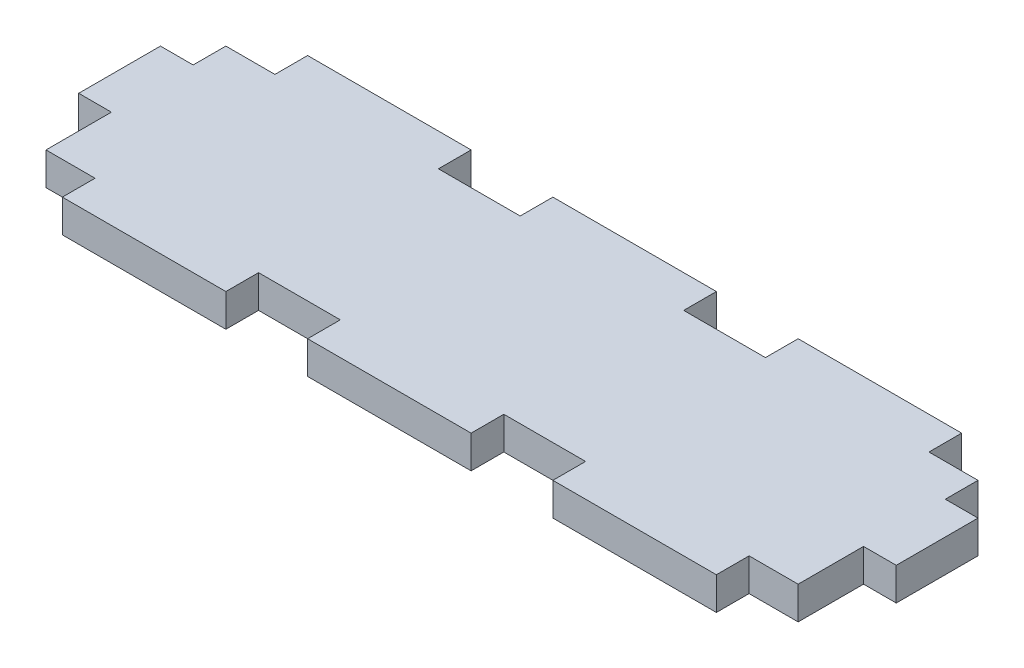
ISO-10303-21;
HEADER;
FILE_DESCRIPTION(('STEP AP214'),'2;1');
FILE_NAME('part.step','',(''),(''),'','','');
FILE_SCHEMA(('AUTOMOTIVE_DESIGN { 1 0 10303 214 1 1 1 1 }'));
ENDSEC;
DATA;
#1=APPLICATION_CONTEXT('core data for automotive mechanical design processes');
#2=APPLICATION_PROTOCOL_DEFINITION('international standard','automotive_design',2000,#1);
#3=PRODUCT_CONTEXT('',#1,'mechanical');
#4=PRODUCT('Part','Part','',(#3));
#5=PRODUCT_RELATED_PRODUCT_CATEGORY('part','',(#4));
#6=PRODUCT_DEFINITION_FORMATION('','',#4);
#7=PRODUCT_DEFINITION_CONTEXT('part definition',#1,'design');
#8=PRODUCT_DEFINITION('design','',#6,#7);
#9=PRODUCT_DEFINITION_SHAPE('','',#8);
#10=(LENGTH_UNIT() NAMED_UNIT(*) SI_UNIT(.MILLI.,.METRE.));
#11=(NAMED_UNIT(*) PLANE_ANGLE_UNIT() SI_UNIT($,.RADIAN.));
#12=(NAMED_UNIT(*) SI_UNIT($,.STERADIAN.) SOLID_ANGLE_UNIT());
#13=UNCERTAINTY_MEASURE_WITH_UNIT(LENGTH_MEASURE(1.E-05),#10,'distance_accuracy_value','');
#14=(GEOMETRIC_REPRESENTATION_CONTEXT(3) GLOBAL_UNCERTAINTY_ASSIGNED_CONTEXT((#13)) GLOBAL_UNIT_ASSIGNED_CONTEXT((#10,
#11,#12)) REPRESENTATION_CONTEXT('',''));
#15=CARTESIAN_POINT('',(0.,0.,0.));
#16=DIRECTION('',(0.,0.,1.));
#17=DIRECTION('',(1.,0.,0.));
#18=AXIS2_PLACEMENT_3D('',#15,#16,#17);
#19=CARTESIAN_POINT('',(-58.42,-119.490382641529,-13.97));
#20=DIRECTION('',(0.,0.,1.));
#21=DIRECTION('',(1.,0.,0.));
#22=AXIS2_PLACEMENT_3D('',#19,#20,#21);
#23=PLANE('',#22);
#24=DIRECTION('',(1.,0.,0.));
#25=VECTOR('',#24,1.);
#26=CARTESIAN_POINT('',(-58.42,2.54,-13.97));
#27=LINE('',#26,#25);
#28=CARTESIAN_POINT('',(12.7,2.54,-13.97));
#29=VERTEX_POINT('',#28);
#30=CARTESIAN_POINT('',(25.4,2.54,-13.97));
#31=VERTEX_POINT('',#30);
#32=EDGE_CURVE('E61',#29,#31,#27,.T.);
#33=ORIENTED_EDGE('',*,*,#32,.T.);
#34=DIRECTION('',(0.,1.,0.));
#35=VECTOR('',#34,1.);
#36=CARTESIAN_POINT('',(25.4,-28.4430191290514,-13.97));
#37=LINE('',#36,#35);
#38=CARTESIAN_POINT('',(25.4,-2.54,-13.97));
#39=VERTEX_POINT('',#38);
#40=EDGE_CURVE('E296',#39,#31,#37,.T.);
#41=ORIENTED_EDGE('',*,*,#40,.F.);
#42=DIRECTION('',(-1.,0.,0.));
#43=VECTOR('',#42,1.);
#44=CARTESIAN_POINT('',(-58.42,-2.54,-13.97));
#45=LINE('',#44,#43);
#46=CARTESIAN_POINT('',(12.7,-2.54,-13.97));
#47=VERTEX_POINT('',#46);
#48=EDGE_CURVE('E359',#39,#47,#45,.T.);
#49=ORIENTED_EDGE('',*,*,#48,.T.);
#50=DIRECTION('',(0.,1.,0.));
#51=VECTOR('',#50,1.);
#52=CARTESIAN_POINT('',(12.7,-28.4430191290514,-13.97));
#53=LINE('',#52,#51);
#54=EDGE_CURVE('E326',#47,#29,#53,.T.);
#55=ORIENTED_EDGE('',*,*,#54,.T.);
#56=EDGE_LOOP('',(#33,#41,#49,#55));
#57=FACE_BOUND('',#56,.T.);
#58=ADVANCED_FACE('F35',(#57),#23,.F.);
#59=CARTESIAN_POINT('',(-25.4,2.54,-13.97));
#60=VERTEX_POINT('',#59);
#61=CARTESIAN_POINT('',(-12.7,2.54,-13.97));
#62=VERTEX_POINT('',#61);
#63=EDGE_CURVE('E600',#60,#62,#27,.T.);
#64=ORIENTED_EDGE('',*,*,#63,.T.);
#65=DIRECTION('',(0.,1.,0.));
#66=VECTOR('',#65,1.);
#67=CARTESIAN_POINT('',(-12.7,-28.4430191290514,-13.97));
#68=LINE('',#67,#66);
#69=CARTESIAN_POINT('',(-12.7,-2.54,-13.97));
#70=VERTEX_POINT('',#69);
#71=EDGE_CURVE('E322',#70,#62,#68,.T.);
#72=ORIENTED_EDGE('',*,*,#71,.F.);
#73=CARTESIAN_POINT('',(-25.4,-2.54,-13.97));
#74=VERTEX_POINT('',#73);
#75=EDGE_CURVE('E356',#70,#74,#45,.T.);
#76=ORIENTED_EDGE('',*,*,#75,.T.);
#77=DIRECTION('',(0.,1.,0.));
#78=VECTOR('',#77,1.);
#79=CARTESIAN_POINT('',(-25.4,-28.4430191290514,-13.97));
#80=LINE('',#79,#78);
#81=EDGE_CURVE('E343',#74,#60,#80,.T.);
#82=ORIENTED_EDGE('',*,*,#81,.T.);
#83=EDGE_LOOP('',(#64,#72,#76,#82));
#84=FACE_BOUND('',#83,.T.);
#85=ADVANCED_FACE('F624',(#84),#23,.F.);
#86=DIRECTION('',(0.,1.,0.));
#87=VECTOR('',#86,1.);
#88=CARTESIAN_POINT('',(-50.8,-28.4430191290514,-13.97));
#89=LINE('',#88,#87);
#90=CARTESIAN_POINT('',(-50.8,-2.54,-13.97));
#91=VERTEX_POINT('',#90);
#92=CARTESIAN_POINT('',(-50.8,2.54,-13.97));
#93=VERTEX_POINT('',#92);
#94=EDGE_CURVE('E337',#91,#93,#89,.T.);
#95=ORIENTED_EDGE('',*,*,#94,.F.);
#96=CARTESIAN_POINT('',(-58.42,-2.54,-13.97));
#97=VERTEX_POINT('',#96);
#98=EDGE_CURVE('E360',#91,#97,#45,.T.);
#99=ORIENTED_EDGE('',*,*,#98,.T.);
#100=DIRECTION('',(0.,1.,0.));
#101=VECTOR('',#100,1.);
#102=CARTESIAN_POINT('',(-58.42,-119.490382641529,-13.97));
#103=LINE('',#102,#101);
#104=CARTESIAN_POINT('',(-58.42,2.54,-13.97));
#105=VERTEX_POINT('',#104);
#106=EDGE_CURVE('E364',#97,#105,#103,.T.);
#107=ORIENTED_EDGE('',*,*,#106,.T.);
#108=EDGE_CURVE('E595',#105,#93,#27,.T.);
#109=ORIENTED_EDGE('',*,*,#108,.T.);
#110=EDGE_LOOP('',(#95,#99,#107,#109));
#111=FACE_BOUND('',#110,.T.);
#112=ADVANCED_FACE('F654',(#111),#23,.F.);
#113=CARTESIAN_POINT('',(63.5,2.54,19.05));
#114=DIRECTION('',(0.,0.,-1.));
#115=DIRECTION('',(-1.,0.,0.));
#116=AXIS2_PLACEMENT_3D('',#113,#114,#115);
#117=PLANE('',#116);
#118=DIRECTION('',(1.,0.,0.));
#119=VECTOR('',#118,1.);
#120=CARTESIAN_POINT('',(63.5,2.54,19.05));
#121=LINE('',#120,#119);
#122=CARTESIAN_POINT('',(25.4,2.54,19.05));
#123=VERTEX_POINT('',#122);
#124=CARTESIAN_POINT('',(50.8,2.54,19.05));
#125=VERTEX_POINT('',#124);
#126=EDGE_CURVE('E397',#123,#125,#121,.T.);
#127=ORIENTED_EDGE('',*,*,#126,.F.);
#128=DIRECTION('',(0.,1.,0.));
#129=VECTOR('',#128,1.);
#130=CARTESIAN_POINT('',(25.4,-16.2183186101216,19.05));
#131=LINE('',#130,#129);
#132=CARTESIAN_POINT('',(25.4,-2.54,19.05));
#133=VERTEX_POINT('',#132);
#134=EDGE_CURVE('E523',#133,#123,#131,.T.);
#135=ORIENTED_EDGE('',*,*,#134,.F.);
#136=DIRECTION('',(1.,0.,0.));
#137=VECTOR('',#136,1.);
#138=CARTESIAN_POINT('',(63.5,-2.54,19.05));
#139=LINE('',#138,#137);
#140=CARTESIAN_POINT('',(50.8,-2.54,19.05));
#141=VERTEX_POINT('',#140);
#142=EDGE_CURVE('E387',#133,#141,#139,.T.);
#143=ORIENTED_EDGE('',*,*,#142,.T.);
#144=DIRECTION('',(0.,1.,0.));
#145=VECTOR('',#144,1.);
#146=CARTESIAN_POINT('',(50.8,-16.2183186101216,19.05));
#147=LINE('',#146,#145);
#148=EDGE_CURVE('E473',#141,#125,#147,.T.);
#149=ORIENTED_EDGE('',*,*,#148,.T.);
#150=EDGE_LOOP('',(#127,#135,#143,#149));
#151=FACE_BOUND('',#150,.T.);
#152=ADVANCED_FACE('F560',(#151),#117,.F.);
#153=CARTESIAN_POINT('',(-12.7,-2.54,19.05));
#154=VERTEX_POINT('',#153);
#155=CARTESIAN_POINT('',(12.7,-2.54,19.05));
#156=VERTEX_POINT('',#155);
#157=EDGE_CURVE('E386',#154,#156,#139,.T.);
#158=ORIENTED_EDGE('',*,*,#157,.T.);
#159=DIRECTION('',(0.,1.,0.));
#160=VECTOR('',#159,1.);
#161=CARTESIAN_POINT('',(12.7,-16.2183186101216,19.05));
#162=LINE('',#161,#160);
#163=CARTESIAN_POINT('',(12.7,2.54,19.05));
#164=VERTEX_POINT('',#163);
#165=EDGE_CURVE('E520',#156,#164,#162,.T.);
#166=ORIENTED_EDGE('',*,*,#165,.T.);
#167=CARTESIAN_POINT('',(-12.7,2.54,19.05));
#168=VERTEX_POINT('',#167);
#169=EDGE_CURVE('E396',#168,#164,#121,.T.);
#170=ORIENTED_EDGE('',*,*,#169,.F.);
#171=DIRECTION('',(0.,1.,0.));
#172=VECTOR('',#171,1.);
#173=CARTESIAN_POINT('',(-12.7,-16.2183186101216,19.05));
#174=LINE('',#173,#172);
#175=EDGE_CURVE('E500',#154,#168,#174,.T.);
#176=ORIENTED_EDGE('',*,*,#175,.F.);
#177=EDGE_LOOP('',(#158,#166,#170,#176));
#178=FACE_BOUND('',#177,.T.);
#179=ADVANCED_FACE('F555',(#178),#117,.F.);
#180=CARTESIAN_POINT('',(0.,2.54,0.));
#181=DIRECTION('',(0.,1.,0.));
#182=DIRECTION('',(0.,0.,1.));
#183=AXIS2_PLACEMENT_3D('',#180,#181,#182);
#184=PLANE('',#183);
#185=ORIENTED_EDGE('',*,*,#108,.F.);
#186=DIRECTION('',(0.,0.,-1.));
#187=VECTOR('',#186,1.);
#188=CARTESIAN_POINT('',(-58.42,2.54,-19.05));
#189=LINE('',#188,#187);
#190=CARTESIAN_POINT('',(-58.42,2.54,-8.89));
#191=VERTEX_POINT('',#190);
#192=EDGE_CURVE('E408',#191,#105,#189,.T.);
#193=ORIENTED_EDGE('',*,*,#192,.F.);
#194=DIRECTION('',(1.,0.,0.));
#195=VECTOR('',#194,1.);
#196=CARTESIAN_POINT('',(-63.5,2.54,-8.89));
#197=LINE('',#196,#195);
#198=CARTESIAN_POINT('',(-63.5,2.54,-8.89));
#199=VERTEX_POINT('',#198);
#200=EDGE_CURVE('E404',#199,#191,#197,.T.);
#201=ORIENTED_EDGE('',*,*,#200,.F.);
#202=DIRECTION('',(0.,0.,1.));
#203=VECTOR('',#202,1.);
#204=CARTESIAN_POINT('',(-63.5,2.54,19.05));
#205=LINE('',#204,#203);
#206=CARTESIAN_POINT('',(-63.5,2.54,3.80999999999999));
#207=VERTEX_POINT('',#206);
#208=EDGE_CURVE('E382',#199,#207,#205,.T.);
#209=ORIENTED_EDGE('',*,*,#208,.T.);
#210=DIRECTION('',(-1.,0.,0.));
#211=VECTOR('',#210,1.);
#212=CARTESIAN_POINT('',(-63.5,2.54,3.80999999999999));
#213=LINE('',#212,#211);
#214=CARTESIAN_POINT('',(-58.42,2.54,3.80999999999999));
#215=VERTEX_POINT('',#214);
#216=EDGE_CURVE('E422',#215,#207,#213,.T.);
#217=ORIENTED_EDGE('',*,*,#216,.F.);
#218=DIRECTION('',(0.,0.,-1.));
#219=VECTOR('',#218,1.);
#220=CARTESIAN_POINT('',(-58.42,2.54,3.80999999999999));
#221=LINE('',#220,#219);
#222=CARTESIAN_POINT('',(-58.42,2.54,13.97));
#223=VERTEX_POINT('',#222);
#224=EDGE_CURVE('E425',#223,#215,#221,.T.);
#225=ORIENTED_EDGE('',*,*,#224,.F.);
#226=DIRECTION('',(-1.,0.,0.));
#227=VECTOR('',#226,1.);
#228=CARTESIAN_POINT('',(-63.5,2.54,13.97));
#229=LINE('',#228,#227);
#230=CARTESIAN_POINT('',(-50.8,2.54,13.97));
#231=VERTEX_POINT('',#230);
#232=EDGE_CURVE('E465',#231,#223,#229,.T.);
#233=ORIENTED_EDGE('',*,*,#232,.F.);
#234=DIRECTION('',(0.,0.,-1.));
#235=VECTOR('',#234,1.);
#236=CARTESIAN_POINT('',(-50.8,2.54,13.97));
#237=LINE('',#236,#235);
#238=CARTESIAN_POINT('',(-50.8,2.54,19.05));
#239=VERTEX_POINT('',#238);
#240=EDGE_CURVE('E468',#239,#231,#237,.T.);
#241=ORIENTED_EDGE('',*,*,#240,.F.);
#242=CARTESIAN_POINT('',(-25.4,2.54,19.05));
#243=VERTEX_POINT('',#242);
#244=EDGE_CURVE('E393',#239,#243,#121,.T.);
#245=ORIENTED_EDGE('',*,*,#244,.T.);
#246=DIRECTION('',(0.,0.,1.));
#247=VECTOR('',#246,1.);
#248=CARTESIAN_POINT('',(-25.4,2.54,13.97));
#249=LINE('',#248,#247);
#250=CARTESIAN_POINT('',(-25.4,2.54,13.97));
#251=VERTEX_POINT('',#250);
#252=EDGE_CURVE('E495',#251,#243,#249,.T.);
#253=ORIENTED_EDGE('',*,*,#252,.F.);
#254=DIRECTION('',(-1.,0.,0.));
#255=VECTOR('',#254,1.);
#256=CARTESIAN_POINT('',(-25.4,2.54,13.97));
#257=LINE('',#256,#255);
#258=CARTESIAN_POINT('',(-12.7,2.54,13.97));
#259=VERTEX_POINT('',#258);
#260=EDGE_CURVE('E504',#259,#251,#257,.T.);
#261=ORIENTED_EDGE('',*,*,#260,.F.);
#262=DIRECTION('',(0.,0.,-1.));
#263=VECTOR('',#262,1.);
#264=CARTESIAN_POINT('',(-12.7,2.54,13.97));
#265=LINE('',#264,#263);
#266=EDGE_CURVE('E507',#168,#259,#265,.T.);
#267=ORIENTED_EDGE('',*,*,#266,.F.);
#268=ORIENTED_EDGE('',*,*,#169,.T.);
#269=DIRECTION('',(0.,0.,1.));
#270=VECTOR('',#269,1.);
#271=CARTESIAN_POINT('',(12.7,2.54,13.97));
#272=LINE('',#271,#270);
#273=CARTESIAN_POINT('',(12.7,2.54,13.97));
#274=VERTEX_POINT('',#273);
#275=EDGE_CURVE('E518',#274,#164,#272,.T.);
#276=ORIENTED_EDGE('',*,*,#275,.F.);
#277=DIRECTION('',(-1.,0.,0.));
#278=VECTOR('',#277,1.);
#279=CARTESIAN_POINT('',(12.7,2.54,13.97));
#280=LINE('',#279,#278);
#281=CARTESIAN_POINT('',(25.4,2.54,13.97));
#282=VERTEX_POINT('',#281);
#283=EDGE_CURVE('E526',#282,#274,#280,.T.);
#284=ORIENTED_EDGE('',*,*,#283,.F.);
#285=DIRECTION('',(0.,0.,-1.));
#286=VECTOR('',#285,1.);
#287=CARTESIAN_POINT('',(25.4,2.54,13.97));
#288=LINE('',#287,#286);
#289=EDGE_CURVE('E375',#123,#282,#288,.T.);
#290=ORIENTED_EDGE('',*,*,#289,.F.);
#291=ORIENTED_EDGE('',*,*,#126,.T.);
#292=DIRECTION('',(0.,0.,-1.));
#293=VECTOR('',#292,1.);
#294=CARTESIAN_POINT('',(50.8,2.54,13.97));
#295=LINE('',#294,#293);
#296=CARTESIAN_POINT('',(50.8,2.54,13.97));
#297=VERTEX_POINT('',#296);
#298=EDGE_CURVE('E482',#125,#297,#295,.T.);
#299=ORIENTED_EDGE('',*,*,#298,.T.);
#300=DIRECTION('',(1.,0.,0.));
#301=VECTOR('',#300,1.);
#302=CARTESIAN_POINT('',(63.5,2.54,13.97));
#303=LINE('',#302,#301);
#304=CARTESIAN_POINT('',(58.42,2.54,13.97));
#305=VERTEX_POINT('',#304);
#306=EDGE_CURVE('E477',#297,#305,#303,.T.);
#307=ORIENTED_EDGE('',*,*,#306,.T.);
#308=DIRECTION('',(0.,0.,-1.));
#309=VECTOR('',#308,1.);
#310=CARTESIAN_POINT('',(58.42,2.54,3.80999999999999));
#311=LINE('',#310,#309);
#312=CARTESIAN_POINT('',(58.42,2.54,3.80999999999999));
#313=VERTEX_POINT('',#312);
#314=EDGE_CURVE('E455',#305,#313,#311,.T.);
#315=ORIENTED_EDGE('',*,*,#314,.T.);
#316=DIRECTION('',(1.,0.,0.));
#317=VECTOR('',#316,1.);
#318=CARTESIAN_POINT('',(63.5,2.54,3.80999999999999));
#319=LINE('',#318,#317);
#320=CARTESIAN_POINT('',(63.5,2.54,3.80999999999999));
#321=VERTEX_POINT('',#320);
#322=EDGE_CURVE('E451',#313,#321,#319,.T.);
#323=ORIENTED_EDGE('',*,*,#322,.T.);
#324=DIRECTION('',(0.,0.,-1.));
#325=VECTOR('',#324,1.);
#326=CARTESIAN_POINT('',(63.5,2.54,19.05));
#327=LINE('',#326,#325);
#328=CARTESIAN_POINT('',(63.5,2.54,-8.89));
#329=VERTEX_POINT('',#328);
#330=EDGE_CURVE('E379',#321,#329,#327,.T.);
#331=ORIENTED_EDGE('',*,*,#330,.T.);
#332=DIRECTION('',(-1.,0.,0.));
#333=VECTOR('',#332,1.);
#334=CARTESIAN_POINT('',(63.5,2.54,-8.89));
#335=LINE('',#334,#333);
#336=CARTESIAN_POINT('',(58.42,2.54,-8.89));
#337=VERTEX_POINT('',#336);
#338=EDGE_CURVE('E436',#329,#337,#335,.T.);
#339=ORIENTED_EDGE('',*,*,#338,.T.);
#340=DIRECTION('',(0.,0.,-1.));
#341=VECTOR('',#340,1.);
#342=CARTESIAN_POINT('',(58.42,2.54,-19.05));
#343=LINE('',#342,#341);
#344=CARTESIAN_POINT('',(58.42,2.54,-13.97));
#345=VERTEX_POINT('',#344);
#346=EDGE_CURVE('E440',#337,#345,#343,.T.);
#347=ORIENTED_EDGE('',*,*,#346,.T.);
#348=CARTESIAN_POINT('',(50.8,2.54,-13.97));
#349=VERTEX_POINT('',#348);
#350=EDGE_CURVE('E39',#349,#345,#27,.T.);
#351=ORIENTED_EDGE('',*,*,#350,.F.);
#352=DIRECTION('',(0.,0.,-1.));
#353=VECTOR('',#352,1.);
#354=CARTESIAN_POINT('',(50.8,2.54,-13.97));
#355=LINE('',#354,#353);
#356=CARTESIAN_POINT('',(50.8,2.54,-19.05));
#357=VERTEX_POINT('',#356);
#358=EDGE_CURVE('E276',#349,#357,#355,.T.);
#359=ORIENTED_EDGE('',*,*,#358,.T.);
#360=DIRECTION('',(-1.,0.,0.));
#361=VECTOR('',#360,1.);
#362=CARTESIAN_POINT('',(25.4,2.54,-19.05));
#363=LINE('',#362,#361);
#364=CARTESIAN_POINT('',(25.4,2.54,-19.05));
#365=VERTEX_POINT('',#364);
#366=EDGE_CURVE('E289',#357,#365,#363,.T.);
#367=ORIENTED_EDGE('',*,*,#366,.T.);
#368=DIRECTION('',(0.,0.,1.));
#369=VECTOR('',#368,1.);
#370=CARTESIAN_POINT('',(25.4,2.54,-13.97));
#371=LINE('',#370,#369);
#372=EDGE_CURVE('E291',#365,#31,#371,.T.);
#373=ORIENTED_EDGE('',*,*,#372,.T.);
#374=ORIENTED_EDGE('',*,*,#32,.F.);
#375=DIRECTION('',(0.,0.,-1.));
#376=VECTOR('',#375,1.);
#377=CARTESIAN_POINT('',(12.7,2.54,-13.97));
#378=LINE('',#377,#376);
#379=CARTESIAN_POINT('',(12.7,2.54,-19.05));
#380=VERTEX_POINT('',#379);
#381=EDGE_CURVE('E315',#29,#380,#378,.T.);
#382=ORIENTED_EDGE('',*,*,#381,.T.);
#383=DIRECTION('',(-1.,0.,0.));
#384=VECTOR('',#383,1.);
#385=CARTESIAN_POINT('',(-12.7,2.54,-19.05));
#386=LINE('',#385,#384);
#387=CARTESIAN_POINT('',(-12.7,2.54,-19.05));
#388=VERTEX_POINT('',#387);
#389=EDGE_CURVE('E319',#380,#388,#386,.T.);
#390=ORIENTED_EDGE('',*,*,#389,.T.);
#391=DIRECTION('',(0.,0.,1.));
#392=VECTOR('',#391,1.);
#393=CARTESIAN_POINT('',(-12.7,2.54,-13.97));
#394=LINE('',#393,#392);
#395=EDGE_CURVE('E312',#388,#62,#394,.T.);
#396=ORIENTED_EDGE('',*,*,#395,.T.);
#397=ORIENTED_EDGE('',*,*,#63,.F.);
#398=DIRECTION('',(0.,0.,-1.));
#399=VECTOR('',#398,1.);
#400=CARTESIAN_POINT('',(-25.4,2.54,-19.05));
#401=LINE('',#400,#399);
#402=CARTESIAN_POINT('',(-25.4,2.54,-19.05));
#403=VERTEX_POINT('',#402);
#404=EDGE_CURVE('E338',#60,#403,#401,.T.);
#405=ORIENTED_EDGE('',*,*,#404,.T.);
#406=DIRECTION('',(-1.,0.,0.));
#407=VECTOR('',#406,1.);
#408=CARTESIAN_POINT('',(-50.8,2.54,-19.05));
#409=LINE('',#408,#407);
#410=CARTESIAN_POINT('',(-50.8,2.54,-19.05));
#411=VERTEX_POINT('',#410);
#412=EDGE_CURVE('E334',#403,#411,#409,.T.);
#413=ORIENTED_EDGE('',*,*,#412,.T.);
#414=DIRECTION('',(0.,0.,1.));
#415=VECTOR('',#414,1.);
#416=CARTESIAN_POINT('',(-50.8,2.54,-19.05));
#417=LINE('',#416,#415);
#418=EDGE_CURVE('E311',#411,#93,#417,.T.);
#419=ORIENTED_EDGE('',*,*,#418,.T.);
#420=EDGE_LOOP('',(#185,#193,#201,#209,#217,#225,#233,#241,#245,#253,#261,#267,#268,#276,#284,
#290,#291,#299,#307,#315,#323,#331,#339,#347,#351,#359,#367,#373,#374,#382,#390,#396,#397,#405,
#413,#419));
#421=FACE_BOUND('',#420,.T.);
#422=ADVANCED_FACE('F287',(#421),#184,.T.);
#423=CARTESIAN_POINT('',(0.,-2.54,0.));
#424=DIRECTION('',(0.,1.,0.));
#425=DIRECTION('',(0.,0.,1.));
#426=AXIS2_PLACEMENT_3D('',#423,#424,#425);
#427=PLANE('',#426);
#428=DIRECTION('',(0.,0.,-1.));
#429=VECTOR('',#428,1.);
#430=CARTESIAN_POINT('',(-58.42,-2.54,-19.05));
#431=LINE('',#430,#429);
#432=CARTESIAN_POINT('',(-58.42,-2.54,-8.89));
#433=VERTEX_POINT('',#432);
#434=EDGE_CURVE('E407',#433,#97,#431,.T.);
#435=ORIENTED_EDGE('',*,*,#434,.T.);
#436=ORIENTED_EDGE('',*,*,#98,.F.);
#437=DIRECTION('',(0.,0.,-1.));
#438=VECTOR('',#437,1.);
#439=CARTESIAN_POINT('',(-50.8,-2.54,-19.05));
#440=LINE('',#439,#438);
#441=CARTESIAN_POINT('',(-50.8,-2.54,-19.05));
#442=VERTEX_POINT('',#441);
#443=EDGE_CURVE('E332',#91,#442,#440,.T.);
#444=ORIENTED_EDGE('',*,*,#443,.T.);
#445=DIRECTION('',(1.,0.,0.));
#446=VECTOR('',#445,1.);
#447=CARTESIAN_POINT('',(-50.8,-2.54,-19.05));
#448=LINE('',#447,#446);
#449=CARTESIAN_POINT('',(-25.4,-2.54,-19.05));
#450=VERTEX_POINT('',#449);
#451=EDGE_CURVE('E330',#442,#450,#448,.T.);
#452=ORIENTED_EDGE('',*,*,#451,.T.);
#453=DIRECTION('',(0.,0.,1.));
#454=VECTOR('',#453,1.);
#455=CARTESIAN_POINT('',(-25.4,-2.54,-19.05));
#456=LINE('',#455,#454);
#457=EDGE_CURVE('E333',#450,#74,#456,.T.);
#458=ORIENTED_EDGE('',*,*,#457,.T.);
#459=ORIENTED_EDGE('',*,*,#75,.F.);
#460=DIRECTION('',(0.,0.,-1.));
#461=VECTOR('',#460,1.);
#462=CARTESIAN_POINT('',(-12.7,-2.54,-13.97));
#463=LINE('',#462,#461);
#464=CARTESIAN_POINT('',(-12.7,-2.54,-19.05));
#465=VERTEX_POINT('',#464);
#466=EDGE_CURVE('E309',#70,#465,#463,.T.);
#467=ORIENTED_EDGE('',*,*,#466,.T.);
#468=DIRECTION('',(1.,0.,0.));
#469=VECTOR('',#468,1.);
#470=CARTESIAN_POINT('',(-12.7,-2.54,-19.05));
#471=LINE('',#470,#469);
#472=CARTESIAN_POINT('',(12.7,-2.54,-19.05));
#473=VERTEX_POINT('',#472);
#474=EDGE_CURVE('E306',#465,#473,#471,.T.);
#475=ORIENTED_EDGE('',*,*,#474,.T.);
#476=DIRECTION('',(0.,0.,1.));
#477=VECTOR('',#476,1.);
#478=CARTESIAN_POINT('',(12.7,-2.54,-13.97));
#479=LINE('',#478,#477);
#480=EDGE_CURVE('E303',#473,#47,#479,.T.);
#481=ORIENTED_EDGE('',*,*,#480,.T.);
#482=ORIENTED_EDGE('',*,*,#48,.F.);
#483=DIRECTION('',(0.,0.,-1.));
#484=VECTOR('',#483,1.);
#485=CARTESIAN_POINT('',(25.4,-2.54,-13.97));
#486=LINE('',#485,#484);
#487=CARTESIAN_POINT('',(25.4,-2.54,-19.05));
#488=VERTEX_POINT('',#487);
#489=EDGE_CURVE('E316',#39,#488,#486,.T.);
#490=ORIENTED_EDGE('',*,*,#489,.T.);
#491=DIRECTION('',(1.,0.,0.));
#492=VECTOR('',#491,1.);
#493=CARTESIAN_POINT('',(25.4,-2.54,-19.05));
#494=LINE('',#493,#492);
#495=CARTESIAN_POINT('',(50.8,-2.54,-19.05));
#496=VERTEX_POINT('',#495);
#497=EDGE_CURVE('E644',#488,#496,#494,.T.);
#498=ORIENTED_EDGE('',*,*,#497,.T.);
#499=DIRECTION('',(0.,0.,1.));
#500=VECTOR('',#499,1.);
#501=CARTESIAN_POINT('',(50.8,-2.54,-13.97));
#502=LINE('',#501,#500);
#503=CARTESIAN_POINT('',(50.8,-2.54,-13.97));
#504=VERTEX_POINT('',#503);
#505=EDGE_CURVE('E278',#496,#504,#502,.T.);
#506=ORIENTED_EDGE('',*,*,#505,.T.);
#507=CARTESIAN_POINT('',(58.42,-2.54000000000003,-13.97));
#508=VERTEX_POINT('',#507);
#509=EDGE_CURVE('E374',#508,#504,#45,.T.);
#510=ORIENTED_EDGE('',*,*,#509,.F.);
#511=DIRECTION('',(0.,0.,-1.));
#512=VECTOR('',#511,1.);
#513=CARTESIAN_POINT('',(58.42,-2.54,-19.05));
#514=LINE('',#513,#512);
#515=CARTESIAN_POINT('',(58.42,-2.54,-8.89));
#516=VERTEX_POINT('',#515);
#517=EDGE_CURVE('E439',#516,#508,#514,.T.);
#518=ORIENTED_EDGE('',*,*,#517,.F.);
#519=DIRECTION('',(-1.,0.,0.));
#520=VECTOR('',#519,1.);
#521=CARTESIAN_POINT('',(63.5,-2.54,-8.89));
#522=LINE('',#521,#520);
#523=CARTESIAN_POINT('',(63.5,-2.54,-8.89));
#524=VERTEX_POINT('',#523);
#525=EDGE_CURVE('E433',#524,#516,#522,.T.);
#526=ORIENTED_EDGE('',*,*,#525,.F.);
#527=DIRECTION('',(0.,0.,-1.));
#528=VECTOR('',#527,1.);
#529=CARTESIAN_POINT('',(63.5,-2.54,19.05));
#530=LINE('',#529,#528);
#531=CARTESIAN_POINT('',(63.5,-2.54,3.80999999999999));
#532=VERTEX_POINT('',#531);
#533=EDGE_CURVE('E380',#532,#524,#530,.T.);
#534=ORIENTED_EDGE('',*,*,#533,.F.);
#535=DIRECTION('',(1.,0.,0.));
#536=VECTOR('',#535,1.);
#537=CARTESIAN_POINT('',(63.5,-2.54,3.80999999999999));
#538=LINE('',#537,#536);
#539=CARTESIAN_POINT('',(58.42,-2.54,3.80999999999999));
#540=VERTEX_POINT('',#539);
#541=EDGE_CURVE('E448',#540,#532,#538,.T.);
#542=ORIENTED_EDGE('',*,*,#541,.F.);
#543=DIRECTION('',(0.,0.,-1.));
#544=VECTOR('',#543,1.);
#545=CARTESIAN_POINT('',(58.42,-2.54,3.80999999999999));
#546=LINE('',#545,#544);
#547=CARTESIAN_POINT('',(58.42,-2.54,13.97));
#548=VERTEX_POINT('',#547);
#549=EDGE_CURVE('E454',#548,#540,#546,.T.);
#550=ORIENTED_EDGE('',*,*,#549,.F.);
#551=DIRECTION('',(-1.,0.,0.));
#552=VECTOR('',#551,1.);
#553=CARTESIAN_POINT('',(63.5,-2.54,13.97));
#554=LINE('',#553,#552);
#555=CARTESIAN_POINT('',(50.8,-2.54,13.97));
#556=VERTEX_POINT('',#555);
#557=EDGE_CURVE('E479',#548,#556,#554,.T.);
#558=ORIENTED_EDGE('',*,*,#557,.T.);
#559=DIRECTION('',(0.,0.,1.));
#560=VECTOR('',#559,1.);
#561=CARTESIAN_POINT('',(50.8,-2.54,13.97));
#562=LINE('',#561,#560);
#563=EDGE_CURVE('E471',#556,#141,#562,.T.);
#564=ORIENTED_EDGE('',*,*,#563,.T.);
#565=ORIENTED_EDGE('',*,*,#142,.F.);
#566=DIRECTION('',(0.,0.,1.));
#567=VECTOR('',#566,1.);
#568=CARTESIAN_POINT('',(25.4,-2.54,13.97));
#569=LINE('',#568,#567);
#570=CARTESIAN_POINT('',(25.4,-2.54,13.97));
#571=VERTEX_POINT('',#570);
#572=EDGE_CURVE('E514',#571,#133,#569,.T.);
#573=ORIENTED_EDGE('',*,*,#572,.F.);
#574=DIRECTION('',(1.,0.,0.));
#575=VECTOR('',#574,1.);
#576=CARTESIAN_POINT('',(12.7,-2.54,13.97));
#577=LINE('',#576,#575);
#578=CARTESIAN_POINT('',(12.7,-2.54,13.97));
#579=VERTEX_POINT('',#578);
#580=EDGE_CURVE('E510',#579,#571,#577,.T.);
#581=ORIENTED_EDGE('',*,*,#580,.F.);
#582=DIRECTION('',(0.,0.,-1.));
#583=VECTOR('',#582,1.);
#584=CARTESIAN_POINT('',(12.7,-2.54,13.97));
#585=LINE('',#584,#583);
#586=EDGE_CURVE('E366',#156,#579,#585,.T.);
#587=ORIENTED_EDGE('',*,*,#586,.F.);
#588=ORIENTED_EDGE('',*,*,#157,.F.);
#589=DIRECTION('',(0.,0.,1.));
#590=VECTOR('',#589,1.);
#591=CARTESIAN_POINT('',(-12.7,-2.54,13.97));
#592=LINE('',#591,#590);
#593=CARTESIAN_POINT('',(-12.7,-2.54,13.97));
#594=VERTEX_POINT('',#593);
#595=EDGE_CURVE('E491',#594,#154,#592,.T.);
#596=ORIENTED_EDGE('',*,*,#595,.F.);
#597=DIRECTION('',(1.,0.,0.));
#598=VECTOR('',#597,1.);
#599=CARTESIAN_POINT('',(-25.4,-2.54,13.97));
#600=LINE('',#599,#598);
#601=CARTESIAN_POINT('',(-25.4,-2.54,13.97));
#602=VERTEX_POINT('',#601);
#603=EDGE_CURVE('E485',#602,#594,#600,.T.);
#604=ORIENTED_EDGE('',*,*,#603,.F.);
#605=DIRECTION('',(0.,0.,-1.));
#606=VECTOR('',#605,1.);
#607=CARTESIAN_POINT('',(-25.4,-2.54,13.97));
#608=LINE('',#607,#606);
#609=CARTESIAN_POINT('',(-25.4,-2.54,19.05));
#610=VERTEX_POINT('',#609);
#611=EDGE_CURVE('E502',#610,#602,#608,.T.);
#612=ORIENTED_EDGE('',*,*,#611,.F.);
#613=CARTESIAN_POINT('',(-50.8,-2.54,19.05));
#614=VERTEX_POINT('',#613);
#615=EDGE_CURVE('E383',#614,#610,#139,.T.);
#616=ORIENTED_EDGE('',*,*,#615,.F.);
#617=DIRECTION('',(0.,0.,1.));
#618=VECTOR('',#617,1.);
#619=CARTESIAN_POINT('',(-50.8,-2.54,13.97));
#620=LINE('',#619,#618);
#621=CARTESIAN_POINT('',(-50.8,-2.54,13.97));
#622=VERTEX_POINT('',#621);
#623=EDGE_CURVE('E461',#622,#614,#620,.T.);
#624=ORIENTED_EDGE('',*,*,#623,.F.);
#625=DIRECTION('',(1.,0.,0.));
#626=VECTOR('',#625,1.);
#627=CARTESIAN_POINT('',(-63.5,-2.54,13.97));
#628=LINE('',#627,#626);
#629=CARTESIAN_POINT('',(-58.42,-2.54,13.97));
#630=VERTEX_POINT('',#629);
#631=EDGE_CURVE('E457',#630,#622,#628,.T.);
#632=ORIENTED_EDGE('',*,*,#631,.F.);
#633=DIRECTION('',(0.,0.,-1.));
#634=VECTOR('',#633,1.);
#635=CARTESIAN_POINT('',(-58.42,-2.54,3.80999999999999));
#636=LINE('',#635,#634);
#637=CARTESIAN_POINT('',(-58.42,-2.54,3.80999999999999));
#638=VERTEX_POINT('',#637);
#639=EDGE_CURVE('E424',#630,#638,#636,.T.);
#640=ORIENTED_EDGE('',*,*,#639,.T.);
#641=DIRECTION('',(-1.,0.,0.));
#642=VECTOR('',#641,1.);
#643=CARTESIAN_POINT('',(-63.5,-2.54,3.80999999999999));
#644=LINE('',#643,#642);
#645=CARTESIAN_POINT('',(-63.5,-2.54,3.81));
#646=VERTEX_POINT('',#645);
#647=EDGE_CURVE('E419',#638,#646,#644,.T.);
#648=ORIENTED_EDGE('',*,*,#647,.T.);
#649=DIRECTION('',(0.,0.,1.));
#650=VECTOR('',#649,1.);
#651=CARTESIAN_POINT('',(-63.5,-2.54,19.05));
#652=LINE('',#651,#650);
#653=CARTESIAN_POINT('',(-63.5,-2.54,-8.89));
#654=VERTEX_POINT('',#653);
#655=EDGE_CURVE('E388',#654,#646,#652,.T.);
#656=ORIENTED_EDGE('',*,*,#655,.F.);
#657=DIRECTION('',(1.,0.,0.));
#658=VECTOR('',#657,1.);
#659=CARTESIAN_POINT('',(-63.5,-2.54,-8.89));
#660=LINE('',#659,#658);
#661=EDGE_CURVE('E402',#654,#433,#660,.T.);
#662=ORIENTED_EDGE('',*,*,#661,.T.);
#663=EDGE_LOOP('',(#435,#436,#444,#452,#458,#459,#467,#475,#481,#482,#490,#498,#506,#510,#518,
#526,#534,#542,#550,#558,#564,#565,#573,#581,#587,#588,#596,#604,#612,#616,#624,#632,#640,#648,
#656,#662));
#664=FACE_BOUND('',#663,.T.);
#665=ADVANCED_FACE('F542',(#664),#427,.F.);
#666=ORIENTED_EDGE('',*,*,#615,.T.);
#667=DIRECTION('',(0.,1.,0.));
#668=VECTOR('',#667,1.);
#669=CARTESIAN_POINT('',(-25.4,-16.2183186101216,19.05));
#670=LINE('',#669,#668);
#671=EDGE_CURVE('E497',#610,#243,#670,.T.);
#672=ORIENTED_EDGE('',*,*,#671,.T.);
#673=ORIENTED_EDGE('',*,*,#244,.F.);
#674=DIRECTION('',(0.,1.,0.));
#675=VECTOR('',#674,1.);
#676=CARTESIAN_POINT('',(-50.8,-16.2183186101216,19.05));
#677=LINE('',#676,#675);
#678=EDGE_CURVE('E464',#614,#239,#677,.T.);
#679=ORIENTED_EDGE('',*,*,#678,.F.);
#680=EDGE_LOOP('',(#666,#672,#673,#679));
#681=FACE_BOUND('',#680,.T.);
#682=ADVANCED_FACE('F670',(#681),#117,.F.);
#683=CARTESIAN_POINT('',(58.42,-2.54,3.80999999999999));
#684=DIRECTION('',(1.,0.,0.));
#685=DIRECTION('',(0.,0.,-1.));
#686=AXIS2_PLACEMENT_3D('',#683,#684,#685);
#687=PLANE('',#686);
#688=ORIENTED_EDGE('',*,*,#314,.F.);
#689=DIRECTION('',(0.,-1.,0.));
#690=VECTOR('',#689,1.);
#691=CARTESIAN_POINT('',(58.42,-2.54,13.97));
#692=LINE('',#691,#690);
#693=EDGE_CURVE('E11',#305,#548,#692,.T.);
#694=ORIENTED_EDGE('',*,*,#693,.T.);
#695=ORIENTED_EDGE('',*,*,#549,.T.);
#696=DIRECTION('',(0.,1.,0.));
#697=VECTOR('',#696,1.);
#698=CARTESIAN_POINT('',(58.42,-2.54,3.80999999999999));
#699=LINE('',#698,#697);
#700=EDGE_CURVE('E442',#540,#313,#699,.T.);
#701=ORIENTED_EDGE('',*,*,#700,.T.);
#702=EDGE_LOOP('',(#688,#694,#695,#701));
#703=FACE_BOUND('',#702,.T.);
#704=ADVANCED_FACE('F572',(#703),#687,.T.);
#705=CARTESIAN_POINT('',(63.5,2.54,19.05));
#706=DIRECTION('',(-1.,0.,0.));
#707=DIRECTION('',(0.,0.,1.));
#708=AXIS2_PLACEMENT_3D('',#705,#706,#707);
#709=PLANE('',#708);
#710=DIRECTION('',(0.,1.,0.));
#711=VECTOR('',#710,1.);
#712=CARTESIAN_POINT('',(63.5,-2.54,3.80999999999999));
#713=LINE('',#712,#711);
#714=EDGE_CURVE('E446',#532,#321,#713,.T.);
#715=ORIENTED_EDGE('',*,*,#714,.F.);
#716=ORIENTED_EDGE('',*,*,#533,.T.);
#717=DIRECTION('',(0.,1.,0.));
#718=VECTOR('',#717,1.);
#719=CARTESIAN_POINT('',(63.5,-2.54,-8.89));
#720=LINE('',#719,#718);
#721=EDGE_CURVE('E427',#524,#329,#720,.T.);
#722=ORIENTED_EDGE('',*,*,#721,.T.);
#723=ORIENTED_EDGE('',*,*,#330,.F.);
#724=EDGE_LOOP('',(#715,#716,#722,#723));
#725=FACE_BOUND('',#724,.T.);
#726=ADVANCED_FACE('F581',(#725),#709,.F.);
#727=CARTESIAN_POINT('',(-63.5,2.54,19.05));
#728=DIRECTION('',(1.,0.,0.));
#729=DIRECTION('',(0.,0.,-1.));
#730=AXIS2_PLACEMENT_3D('',#727,#728,#729);
#731=PLANE('',#730);
#732=ORIENTED_EDGE('',*,*,#655,.T.);
#733=DIRECTION('',(0.,1.,0.));
#734=VECTOR('',#733,1.);
#735=CARTESIAN_POINT('',(-63.5,-2.54,3.80999999999999));
#736=LINE('',#735,#734);
#737=EDGE_CURVE('E411',#646,#207,#736,.T.);
#738=ORIENTED_EDGE('',*,*,#737,.T.);
#739=ORIENTED_EDGE('',*,*,#208,.F.);
#740=DIRECTION('',(0.,1.,0.));
#741=VECTOR('',#740,1.);
#742=CARTESIAN_POINT('',(-63.5,-2.54,-8.89));
#743=LINE('',#742,#741);
#744=EDGE_CURVE('E400',#654,#199,#743,.T.);
#745=ORIENTED_EDGE('',*,*,#744,.F.);
#746=EDGE_LOOP('',(#732,#738,#739,#745));
#747=FACE_BOUND('',#746,.T.);
#748=ADVANCED_FACE('F37',(#747),#731,.F.);
#749=CARTESIAN_POINT('',(-58.42,-2.54,-19.05));
#750=DIRECTION('',(1.,0.,0.));
#751=DIRECTION('',(0.,0.,-1.));
#752=AXIS2_PLACEMENT_3D('',#749,#750,#751);
#753=PLANE('',#752);
#754=ORIENTED_EDGE('',*,*,#192,.T.);
#755=ORIENTED_EDGE('',*,*,#106,.F.);
#756=ORIENTED_EDGE('',*,*,#434,.F.);
#757=DIRECTION('',(0.,1.,0.));
#758=VECTOR('',#757,1.);
#759=CARTESIAN_POINT('',(-58.42,-2.54,-8.89));
#760=LINE('',#759,#758);
#761=EDGE_CURVE('E391',#433,#191,#760,.T.);
#762=ORIENTED_EDGE('',*,*,#761,.T.);
#763=EDGE_LOOP('',(#754,#755,#756,#762));
#764=FACE_BOUND('',#763,.T.);
#765=ADVANCED_FACE('F679',(#764),#753,.F.);
#766=CARTESIAN_POINT('',(-63.5,-2.54,-8.89));
#767=DIRECTION('',(0.,0.,1.));
#768=DIRECTION('',(1.,0.,0.));
#769=AXIS2_PLACEMENT_3D('',#766,#767,#768);
#770=PLANE('',#769);
#771=ORIENTED_EDGE('',*,*,#200,.T.);
#772=ORIENTED_EDGE('',*,*,#761,.F.);
#773=ORIENTED_EDGE('',*,*,#661,.F.);
#774=ORIENTED_EDGE('',*,*,#744,.T.);
#775=EDGE_LOOP('',(#771,#772,#773,#774));
#776=FACE_BOUND('',#775,.T.);
#777=ADVANCED_FACE('F682',(#776),#770,.F.);
#778=CARTESIAN_POINT('',(-58.42,-2.54,3.80999999999999));
#779=DIRECTION('',(1.,0.,0.));
#780=DIRECTION('',(0.,0.,-1.));
#781=AXIS2_PLACEMENT_3D('',#778,#779,#780);
#782=PLANE('',#781);
#783=ORIENTED_EDGE('',*,*,#639,.F.);
#784=DIRECTION('',(0.,1.,0.));
#785=VECTOR('',#784,1.);
#786=CARTESIAN_POINT('',(-58.42,-2.54,13.97));
#787=LINE('',#786,#785);
#788=EDGE_CURVE('E45',#630,#223,#787,.T.);
#789=ORIENTED_EDGE('',*,*,#788,.T.);
#790=ORIENTED_EDGE('',*,*,#224,.T.);
#791=DIRECTION('',(0.,1.,0.));
#792=VECTOR('',#791,1.);
#793=CARTESIAN_POINT('',(-58.42,-2.54,3.80999999999999));
#794=LINE('',#793,#792);
#795=EDGE_CURVE('E416',#638,#215,#794,.T.);
#796=ORIENTED_EDGE('',*,*,#795,.F.);
#797=EDGE_LOOP('',(#783,#789,#790,#796));
#798=FACE_BOUND('',#797,.T.);
#799=ADVANCED_FACE('F696',(#798),#782,.F.);
#800=CARTESIAN_POINT('',(-63.5,-2.54,3.80999999999999));
#801=DIRECTION('',(0.,0.,-1.));
#802=DIRECTION('',(-1.,0.,0.));
#803=AXIS2_PLACEMENT_3D('',#800,#801,#802);
#804=PLANE('',#803);
#805=ORIENTED_EDGE('',*,*,#216,.T.);
#806=ORIENTED_EDGE('',*,*,#737,.F.);
#807=ORIENTED_EDGE('',*,*,#647,.F.);
#808=ORIENTED_EDGE('',*,*,#795,.T.);
#809=EDGE_LOOP('',(#805,#806,#807,#808));
#810=FACE_BOUND('',#809,.T.);
#811=ADVANCED_FACE('F690',(#810),#804,.F.);
#812=CARTESIAN_POINT('',(58.42,-2.54,-19.05));
#813=DIRECTION('',(1.,0.,0.));
#814=DIRECTION('',(0.,0.,-1.));
#815=AXIS2_PLACEMENT_3D('',#812,#813,#814);
#816=PLANE('',#815);
#817=DIRECTION('',(0.,1.,0.));
#818=VECTOR('',#817,1.);
#819=CARTESIAN_POINT('',(58.42,-119.490382641529,-13.97));
#820=LINE('',#819,#818);
#821=EDGE_CURVE('E594',#508,#345,#820,.T.);
#822=ORIENTED_EDGE('',*,*,#821,.T.);
#823=ORIENTED_EDGE('',*,*,#346,.F.);
#824=DIRECTION('',(0.,1.,0.));
#825=VECTOR('',#824,1.);
#826=CARTESIAN_POINT('',(58.42,-2.54,-8.89));
#827=LINE('',#826,#825);
#828=EDGE_CURVE('E431',#516,#337,#827,.T.);
#829=ORIENTED_EDGE('',*,*,#828,.F.);
#830=ORIENTED_EDGE('',*,*,#517,.T.);
#831=EDGE_LOOP('',(#822,#823,#829,#830));
#832=FACE_BOUND('',#831,.T.);
#833=ADVANCED_FACE('F593',(#832),#816,.T.);
#834=CARTESIAN_POINT('',(63.5,-2.54,-8.89));
#835=DIRECTION('',(0.,0.,-1.));
#836=DIRECTION('',(-1.,0.,0.));
#837=AXIS2_PLACEMENT_3D('',#834,#835,#836);
#838=PLANE('',#837);
#839=ORIENTED_EDGE('',*,*,#338,.F.);
#840=ORIENTED_EDGE('',*,*,#721,.F.);
#841=ORIENTED_EDGE('',*,*,#525,.T.);
#842=ORIENTED_EDGE('',*,*,#828,.T.);
#843=EDGE_LOOP('',(#839,#840,#841,#842));
#844=FACE_BOUND('',#843,.T.);
#845=ADVANCED_FACE('F589',(#844),#838,.T.);
#846=CARTESIAN_POINT('',(63.5,-2.54,3.80999999999999));
#847=DIRECTION('',(0.,0.,1.));
#848=DIRECTION('',(1.,0.,0.));
#849=AXIS2_PLACEMENT_3D('',#846,#847,#848);
#850=PLANE('',#849);
#851=ORIENTED_EDGE('',*,*,#322,.F.);
#852=ORIENTED_EDGE('',*,*,#700,.F.);
#853=ORIENTED_EDGE('',*,*,#541,.T.);
#854=ORIENTED_EDGE('',*,*,#714,.T.);
#855=EDGE_LOOP('',(#851,#852,#853,#854));
#856=FACE_BOUND('',#855,.T.);
#857=ADVANCED_FACE('F577',(#856),#850,.T.);
#858=CARTESIAN_POINT('',(-63.5,-16.2183186101216,13.97));
#859=DIRECTION('',(0.,0.,-1.));
#860=DIRECTION('',(-1.,0.,0.));
#861=AXIS2_PLACEMENT_3D('',#858,#859,#860);
#862=PLANE('',#861);
#863=ORIENTED_EDGE('',*,*,#631,.T.);
#864=DIRECTION('',(0.,1.,0.));
#865=VECTOR('',#864,1.);
#866=CARTESIAN_POINT('',(-50.8,-16.2183186101216,13.97));
#867=LINE('',#866,#865);
#868=EDGE_CURVE('E462',#622,#231,#867,.T.);
#869=ORIENTED_EDGE('',*,*,#868,.T.);
#870=ORIENTED_EDGE('',*,*,#232,.T.);
#871=ORIENTED_EDGE('',*,*,#788,.F.);
#872=EDGE_LOOP('',(#863,#869,#870,#871));
#873=FACE_BOUND('',#872,.T.);
#874=ADVANCED_FACE('F702',(#873),#862,.F.);
#875=CARTESIAN_POINT('',(-50.8,-16.2183186101216,13.97));
#876=DIRECTION('',(1.,0.,0.));
#877=DIRECTION('',(0.,0.,-1.));
#878=AXIS2_PLACEMENT_3D('',#875,#876,#877);
#879=PLANE('',#878);
#880=ORIENTED_EDGE('',*,*,#623,.T.);
#881=ORIENTED_EDGE('',*,*,#678,.T.);
#882=ORIENTED_EDGE('',*,*,#240,.T.);
#883=ORIENTED_EDGE('',*,*,#868,.F.);
#884=EDGE_LOOP('',(#880,#881,#882,#883));
#885=FACE_BOUND('',#884,.T.);
#886=ADVANCED_FACE('F705',(#885),#879,.F.);
#887=CARTESIAN_POINT('',(63.5,-16.2183186101216,13.97));
#888=DIRECTION('',(0.,0.,1.));
#889=DIRECTION('',(1.,0.,0.));
#890=AXIS2_PLACEMENT_3D('',#887,#888,#889);
#891=PLANE('',#890);
#892=ORIENTED_EDGE('',*,*,#306,.F.);
#893=DIRECTION('',(0.,1.,0.));
#894=VECTOR('',#893,1.);
#895=CARTESIAN_POINT('',(50.8,-16.2183186101216,13.97));
#896=LINE('',#895,#894);
#897=EDGE_CURVE('E476',#556,#297,#896,.T.);
#898=ORIENTED_EDGE('',*,*,#897,.F.);
#899=ORIENTED_EDGE('',*,*,#557,.F.);
#900=ORIENTED_EDGE('',*,*,#693,.F.);
#901=EDGE_LOOP('',(#892,#898,#899,#900));
#902=FACE_BOUND('',#901,.T.);
#903=ADVANCED_FACE('F569',(#902),#891,.T.);
#904=CARTESIAN_POINT('',(50.8,-16.2183186101216,13.97));
#905=DIRECTION('',(1.,0.,0.));
#906=DIRECTION('',(0.,0.,-1.));
#907=AXIS2_PLACEMENT_3D('',#904,#905,#906);
#908=PLANE('',#907);
#909=ORIENTED_EDGE('',*,*,#897,.T.);
#910=ORIENTED_EDGE('',*,*,#298,.F.);
#911=ORIENTED_EDGE('',*,*,#148,.F.);
#912=ORIENTED_EDGE('',*,*,#563,.F.);
#913=EDGE_LOOP('',(#909,#910,#911,#912));
#914=FACE_BOUND('',#913,.T.);
#915=ADVANCED_FACE('F563',(#914),#908,.T.);
#916=CARTESIAN_POINT('',(-12.7,-16.2183186101216,13.97));
#917=DIRECTION('',(1.,0.,0.));
#918=DIRECTION('',(0.,0.,-1.));
#919=AXIS2_PLACEMENT_3D('',#916,#917,#918);
#920=PLANE('',#919);
#921=ORIENTED_EDGE('',*,*,#595,.T.);
#922=ORIENTED_EDGE('',*,*,#175,.T.);
#923=ORIENTED_EDGE('',*,*,#266,.T.);
#924=DIRECTION('',(0.,1.,0.));
#925=VECTOR('',#924,1.);
#926=CARTESIAN_POINT('',(-12.7,-16.2183186101216,13.97));
#927=LINE('',#926,#925);
#928=EDGE_CURVE('E492',#594,#259,#927,.T.);
#929=ORIENTED_EDGE('',*,*,#928,.F.);
#930=EDGE_LOOP('',(#921,#922,#923,#929));
#931=FACE_BOUND('',#930,.T.);
#932=ADVANCED_FACE('F720',(#931),#920,.F.);
#933=CARTESIAN_POINT('',(-25.4,-16.2183186101216,13.97));
#934=DIRECTION('',(-1.,0.,0.));
#935=DIRECTION('',(0.,0.,1.));
#936=AXIS2_PLACEMENT_3D('',#933,#934,#935);
#937=PLANE('',#936);
#938=ORIENTED_EDGE('',*,*,#611,.T.);
#939=DIRECTION('',(0.,1.,0.));
#940=VECTOR('',#939,1.);
#941=CARTESIAN_POINT('',(-25.4,-16.2183186101216,13.97));
#942=LINE('',#941,#940);
#943=EDGE_CURVE('E494',#602,#251,#942,.T.);
#944=ORIENTED_EDGE('',*,*,#943,.T.);
#945=ORIENTED_EDGE('',*,*,#252,.T.);
#946=ORIENTED_EDGE('',*,*,#671,.F.);
#947=EDGE_LOOP('',(#938,#944,#945,#946));
#948=FACE_BOUND('',#947,.T.);
#949=ADVANCED_FACE('F713',(#948),#937,.F.);
#950=CARTESIAN_POINT('',(-25.4,-16.2183186101216,13.97));
#951=DIRECTION('',(0.,0.,-1.));
#952=DIRECTION('',(-1.,0.,0.));
#953=AXIS2_PLACEMENT_3D('',#950,#951,#952);
#954=PLANE('',#953);
#955=ORIENTED_EDGE('',*,*,#603,.T.);
#956=ORIENTED_EDGE('',*,*,#928,.T.);
#957=ORIENTED_EDGE('',*,*,#260,.T.);
#958=ORIENTED_EDGE('',*,*,#943,.F.);
#959=EDGE_LOOP('',(#955,#956,#957,#958));
#960=FACE_BOUND('',#959,.T.);
#961=ADVANCED_FACE('F715',(#960),#954,.F.);
#962=CARTESIAN_POINT('',(25.4,-16.2183186101216,13.97));
#963=DIRECTION('',(1.,0.,0.));
#964=DIRECTION('',(0.,0.,-1.));
#965=AXIS2_PLACEMENT_3D('',#962,#963,#964);
#966=PLANE('',#965);
#967=ORIENTED_EDGE('',*,*,#572,.T.);
#968=ORIENTED_EDGE('',*,*,#134,.T.);
#969=ORIENTED_EDGE('',*,*,#289,.T.);
#970=DIRECTION('',(0.,1.,0.));
#971=VECTOR('',#970,1.);
#972=CARTESIAN_POINT('',(25.4,-16.2183186101216,13.97));
#973=LINE('',#972,#971);
#974=EDGE_CURVE('E515',#571,#282,#973,.T.);
#975=ORIENTED_EDGE('',*,*,#974,.F.);
#976=EDGE_LOOP('',(#967,#968,#969,#975));
#977=FACE_BOUND('',#976,.T.);
#978=ADVANCED_FACE('F546',(#977),#966,.F.);
#979=CARTESIAN_POINT('',(12.7,-16.2183186101216,13.97));
#980=DIRECTION('',(-1.,0.,0.));
#981=DIRECTION('',(0.,0.,1.));
#982=AXIS2_PLACEMENT_3D('',#979,#980,#981);
#983=PLANE('',#982);
#984=ORIENTED_EDGE('',*,*,#586,.T.);
#985=DIRECTION('',(0.,1.,0.));
#986=VECTOR('',#985,1.);
#987=CARTESIAN_POINT('',(12.7,-16.2183186101216,13.97));
#988=LINE('',#987,#986);
#989=EDGE_CURVE('E517',#579,#274,#988,.T.);
#990=ORIENTED_EDGE('',*,*,#989,.T.);
#991=ORIENTED_EDGE('',*,*,#275,.T.);
#992=ORIENTED_EDGE('',*,*,#165,.F.);
#993=EDGE_LOOP('',(#984,#990,#991,#992));
#994=FACE_BOUND('',#993,.T.);
#995=ADVANCED_FACE('F538',(#994),#983,.F.);
#996=CARTESIAN_POINT('',(12.7,-16.2183186101216,13.97));
#997=DIRECTION('',(0.,0.,-1.));
#998=DIRECTION('',(-1.,0.,0.));
#999=AXIS2_PLACEMENT_3D('',#996,#997,#998);
#1000=PLANE('',#999);
#1001=ORIENTED_EDGE('',*,*,#580,.T.);
#1002=ORIENTED_EDGE('',*,*,#974,.T.);
#1003=ORIENTED_EDGE('',*,*,#283,.T.);
#1004=ORIENTED_EDGE('',*,*,#989,.F.);
#1005=EDGE_LOOP('',(#1001,#1002,#1003,#1004));
#1006=FACE_BOUND('',#1005,.T.);
#1007=ADVANCED_FACE('F545',(#1006),#1000,.F.);
#1008=ORIENTED_EDGE('',*,*,#509,.T.);
#1009=DIRECTION('',(0.,1.,0.));
#1010=VECTOR('',#1009,1.);
#1011=CARTESIAN_POINT('',(50.8,-28.4430191290514,-13.97));
#1012=LINE('',#1011,#1010);
#1013=EDGE_CURVE('E53',#504,#349,#1012,.T.);
#1014=ORIENTED_EDGE('',*,*,#1013,.T.);
#1015=ORIENTED_EDGE('',*,*,#350,.T.);
#1016=ORIENTED_EDGE('',*,*,#821,.F.);
#1017=EDGE_LOOP('',(#1008,#1014,#1015,#1016));
#1018=FACE_BOUND('',#1017,.T.);
#1019=ADVANCED_FACE('F650',(#1018),#23,.F.);
#1020=CARTESIAN_POINT('',(-50.8,-28.4430191290514,-19.05));
#1021=DIRECTION('',(-1.,0.,0.));
#1022=DIRECTION('',(0.,0.,1.));
#1023=AXIS2_PLACEMENT_3D('',#1020,#1021,#1022);
#1024=PLANE('',#1023);
#1025=ORIENTED_EDGE('',*,*,#443,.F.);
#1026=ORIENTED_EDGE('',*,*,#94,.T.);
#1027=ORIENTED_EDGE('',*,*,#418,.F.);
#1028=DIRECTION('',(0.,1.,0.));
#1029=VECTOR('',#1028,1.);
#1030=CARTESIAN_POINT('',(-50.8,-28.4430191290514,-19.05));
#1031=LINE('',#1030,#1029);
#1032=EDGE_CURVE('E339',#442,#411,#1031,.T.);
#1033=ORIENTED_EDGE('',*,*,#1032,.F.);
#1034=EDGE_LOOP('',(#1025,#1026,#1027,#1033));
#1035=FACE_BOUND('',#1034,.T.);
#1036=ADVANCED_FACE('F658',(#1035),#1024,.T.);
#1037=CARTESIAN_POINT('',(-50.8,-28.4430191290514,-19.05));
#1038=DIRECTION('',(0.,0.,-1.));
#1039=DIRECTION('',(-1.,0.,0.));
#1040=AXIS2_PLACEMENT_3D('',#1037,#1038,#1039);
#1041=PLANE('',#1040);
#1042=ORIENTED_EDGE('',*,*,#451,.F.);
#1043=ORIENTED_EDGE('',*,*,#1032,.T.);
#1044=ORIENTED_EDGE('',*,*,#412,.F.);
#1045=DIRECTION('',(0.,1.,0.));
#1046=VECTOR('',#1045,1.);
#1047=CARTESIAN_POINT('',(-25.4,-28.4430191290514,-19.05));
#1048=LINE('',#1047,#1046);
#1049=EDGE_CURVE('E341',#450,#403,#1048,.T.);
#1050=ORIENTED_EDGE('',*,*,#1049,.F.);
#1051=EDGE_LOOP('',(#1042,#1043,#1044,#1050));
#1052=FACE_BOUND('',#1051,.T.);
#1053=ADVANCED_FACE('F663',(#1052),#1041,.T.);
#1054=CARTESIAN_POINT('',(-25.4,-28.4430191290514,-19.05));
#1055=DIRECTION('',(1.,0.,0.));
#1056=DIRECTION('',(0.,0.,-1.));
#1057=AXIS2_PLACEMENT_3D('',#1054,#1055,#1056);
#1058=PLANE('',#1057);
#1059=ORIENTED_EDGE('',*,*,#457,.F.);
#1060=ORIENTED_EDGE('',*,*,#1049,.T.);
#1061=ORIENTED_EDGE('',*,*,#404,.F.);
#1062=ORIENTED_EDGE('',*,*,#81,.F.);
#1063=EDGE_LOOP('',(#1059,#1060,#1061,#1062));
#1064=FACE_BOUND('',#1063,.T.);
#1065=ADVANCED_FACE('F623',(#1064),#1058,.T.);
#1066=CARTESIAN_POINT('',(-12.7,-28.4430191290514,-13.97));
#1067=DIRECTION('',(-1.,0.,0.));
#1068=DIRECTION('',(0.,0.,1.));
#1069=AXIS2_PLACEMENT_3D('',#1066,#1067,#1068);
#1070=PLANE('',#1069);
#1071=ORIENTED_EDGE('',*,*,#466,.F.);
#1072=ORIENTED_EDGE('',*,*,#71,.T.);
#1073=ORIENTED_EDGE('',*,*,#395,.F.);
#1074=DIRECTION('',(0.,1.,0.));
#1075=VECTOR('',#1074,1.);
#1076=CARTESIAN_POINT('',(-12.7,-28.4430191290514,-19.05));
#1077=LINE('',#1076,#1075);
#1078=EDGE_CURVE('E307',#465,#388,#1077,.T.);
#1079=ORIENTED_EDGE('',*,*,#1078,.F.);
#1080=EDGE_LOOP('',(#1071,#1072,#1073,#1079));
#1081=FACE_BOUND('',#1080,.T.);
#1082=ADVANCED_FACE('F631',(#1081),#1070,.T.);
#1083=CARTESIAN_POINT('',(-12.7,-28.4430191290514,-19.05));
#1084=DIRECTION('',(0.,0.,-1.));
#1085=DIRECTION('',(-1.,0.,0.));
#1086=AXIS2_PLACEMENT_3D('',#1083,#1084,#1085);
#1087=PLANE('',#1086);
#1088=ORIENTED_EDGE('',*,*,#474,.F.);
#1089=ORIENTED_EDGE('',*,*,#1078,.T.);
#1090=ORIENTED_EDGE('',*,*,#389,.F.);
#1091=DIRECTION('',(0.,1.,0.));
#1092=VECTOR('',#1091,1.);
#1093=CARTESIAN_POINT('',(12.7,-28.4430191290514,-19.05));
#1094=LINE('',#1093,#1092);
#1095=EDGE_CURVE('E324',#473,#380,#1094,.T.);
#1096=ORIENTED_EDGE('',*,*,#1095,.F.);
#1097=EDGE_LOOP('',(#1088,#1089,#1090,#1096));
#1098=FACE_BOUND('',#1097,.T.);
#1099=ADVANCED_FACE('F636',(#1098),#1087,.T.);
#1100=CARTESIAN_POINT('',(12.7,-28.4430191290514,-13.97));
#1101=DIRECTION('',(1.,0.,0.));
#1102=DIRECTION('',(0.,0.,-1.));
#1103=AXIS2_PLACEMENT_3D('',#1100,#1101,#1102);
#1104=PLANE('',#1103);
#1105=ORIENTED_EDGE('',*,*,#480,.F.);
#1106=ORIENTED_EDGE('',*,*,#1095,.T.);
#1107=ORIENTED_EDGE('',*,*,#381,.F.);
#1108=ORIENTED_EDGE('',*,*,#54,.F.);
#1109=EDGE_LOOP('',(#1105,#1106,#1107,#1108));
#1110=FACE_BOUND('',#1109,.T.);
#1111=ADVANCED_FACE('F639',(#1110),#1104,.T.);
#1112=CARTESIAN_POINT('',(25.4,-28.4430191290514,-13.97));
#1113=DIRECTION('',(-1.,0.,0.));
#1114=DIRECTION('',(0.,0.,1.));
#1115=AXIS2_PLACEMENT_3D('',#1112,#1113,#1114);
#1116=PLANE('',#1115);
#1117=ORIENTED_EDGE('',*,*,#489,.F.);
#1118=ORIENTED_EDGE('',*,*,#40,.T.);
#1119=ORIENTED_EDGE('',*,*,#372,.F.);
#1120=DIRECTION('',(0.,1.,0.));
#1121=VECTOR('',#1120,1.);
#1122=CARTESIAN_POINT('',(25.4,-28.4430191290514,-19.05));
#1123=LINE('',#1122,#1121);
#1124=EDGE_CURVE('E282',#488,#365,#1123,.T.);
#1125=ORIENTED_EDGE('',*,*,#1124,.F.);
#1126=EDGE_LOOP('',(#1117,#1118,#1119,#1125));
#1127=FACE_BOUND('',#1126,.T.);
#1128=ADVANCED_FACE('F647',(#1127),#1116,.T.);
#1129=CARTESIAN_POINT('',(25.4,-28.4430191290514,-19.05));
#1130=DIRECTION('',(0.,0.,-1.));
#1131=DIRECTION('',(-1.,0.,0.));
#1132=AXIS2_PLACEMENT_3D('',#1129,#1130,#1131);
#1133=PLANE('',#1132);
#1134=ORIENTED_EDGE('',*,*,#497,.F.);
#1135=ORIENTED_EDGE('',*,*,#1124,.T.);
#1136=ORIENTED_EDGE('',*,*,#366,.F.);
#1137=DIRECTION('',(0.,1.,0.));
#1138=VECTOR('',#1137,1.);
#1139=CARTESIAN_POINT('',(50.8,-28.4430191290514,-19.05));
#1140=LINE('',#1139,#1138);
#1141=EDGE_CURVE('E273',#496,#357,#1140,.T.);
#1142=ORIENTED_EDGE('',*,*,#1141,.F.);
#1143=EDGE_LOOP('',(#1134,#1135,#1136,#1142));
#1144=FACE_BOUND('',#1143,.T.);
#1145=ADVANCED_FACE('F293',(#1144),#1133,.T.);
#1146=CARTESIAN_POINT('',(50.8,-28.4430191290514,-13.97));
#1147=DIRECTION('',(1.,0.,0.));
#1148=DIRECTION('',(0.,0.,-1.));
#1149=AXIS2_PLACEMENT_3D('',#1146,#1147,#1148);
#1150=PLANE('',#1149);
#1151=ORIENTED_EDGE('',*,*,#505,.F.);
#1152=ORIENTED_EDGE('',*,*,#1141,.T.);
#1153=ORIENTED_EDGE('',*,*,#358,.F.);
#1154=ORIENTED_EDGE('',*,*,#1013,.F.);
#1155=EDGE_LOOP('',(#1151,#1152,#1153,#1154));
#1156=FACE_BOUND('',#1155,.T.);
#1157=ADVANCED_FACE('F275',(#1156),#1150,.T.);
#1158=CLOSED_SHELL('',(#58,#85,#112,#152,#179,#422,#665,#682,#704,#726,#748,#765,#777,#799,#811,
#833,#845,#857,#874,#886,#903,#915,#932,#949,#961,#978,#995,#1007,#1019,#1036,#1053,#1065,#1082,
#1099,#1111,#1128,#1145,#1157));
#1159=MANIFOLD_SOLID_BREP('B2',#1158);
#1160=ADVANCED_BREP_SHAPE_REPRESENTATION('',(#18,#1159),#14);
#1161=SHAPE_DEFINITION_REPRESENTATION(#9,#1160);
ENDSEC;
END-ISO-10303-21;
